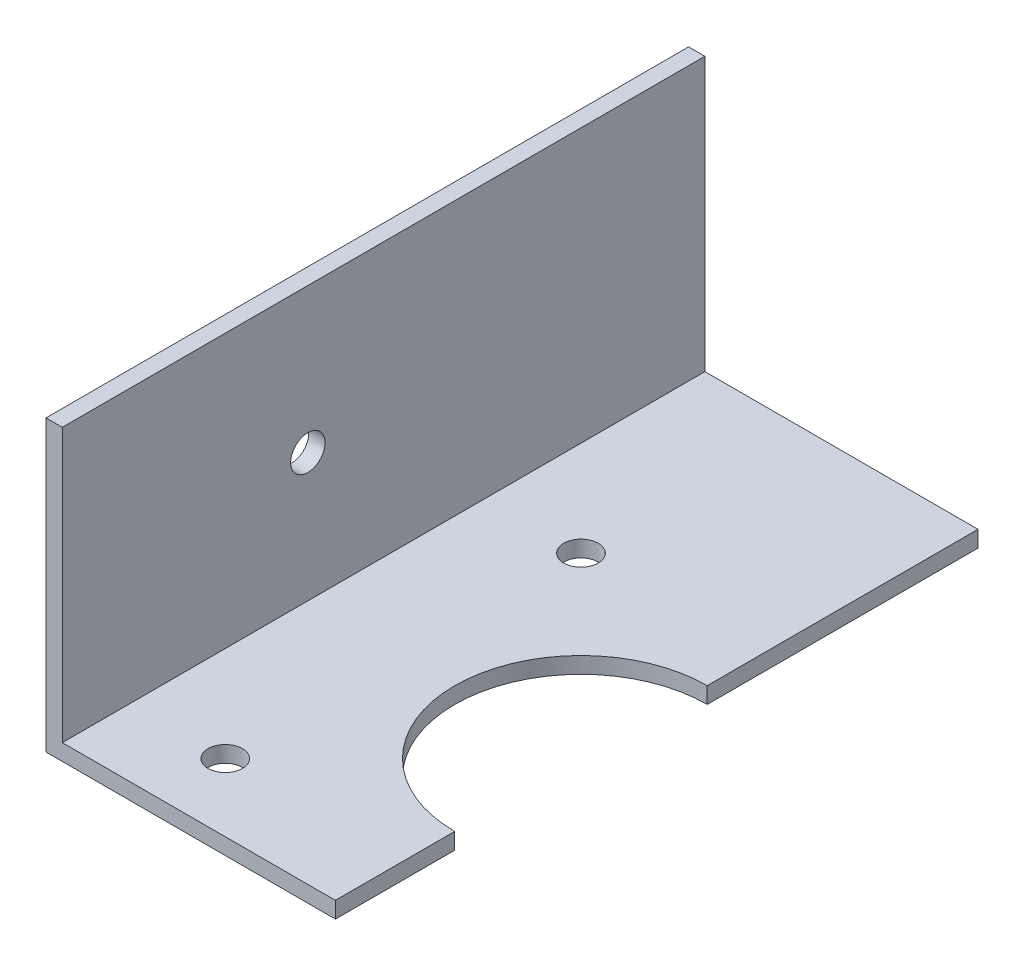
ISO-10303-21;
HEADER;
FILE_DESCRIPTION(('STEP AP214'),'2;1');
FILE_NAME('part.step','',(''),(''),'','','');
FILE_SCHEMA(('AUTOMOTIVE_DESIGN { 1 0 10303 214 1 1 1 1 }'));
ENDSEC;
DATA;
#1=APPLICATION_CONTEXT('core data for automotive mechanical design processes');
#2=APPLICATION_PROTOCOL_DEFINITION('international standard','automotive_design',2000,#1);
#3=PRODUCT_CONTEXT('',#1,'mechanical');
#4=PRODUCT('Part','Part','',(#3));
#5=PRODUCT_RELATED_PRODUCT_CATEGORY('part','',(#4));
#6=PRODUCT_DEFINITION_FORMATION('','',#4);
#7=PRODUCT_DEFINITION_CONTEXT('part definition',#1,'design');
#8=PRODUCT_DEFINITION('design','',#6,#7);
#9=PRODUCT_DEFINITION_SHAPE('','',#8);
#10=(LENGTH_UNIT() NAMED_UNIT(*) SI_UNIT(.MILLI.,.METRE.));
#11=(NAMED_UNIT(*) PLANE_ANGLE_UNIT() SI_UNIT($,.RADIAN.));
#12=(NAMED_UNIT(*) SI_UNIT($,.STERADIAN.) SOLID_ANGLE_UNIT());
#13=UNCERTAINTY_MEASURE_WITH_UNIT(LENGTH_MEASURE(1.E-05),#10,'distance_accuracy_value','');
#14=(GEOMETRIC_REPRESENTATION_CONTEXT(3) GLOBAL_UNCERTAINTY_ASSIGNED_CONTEXT((#13)) GLOBAL_UNIT_ASSIGNED_CONTEXT((#10,
#11,#12)) REPRESENTATION_CONTEXT('',''));
#15=CARTESIAN_POINT('',(0.,0.,0.));
#16=DIRECTION('',(0.,0.,1.));
#17=DIRECTION('',(1.,0.,0.));
#18=AXIS2_PLACEMENT_3D('',#15,#16,#17);
#19=CARTESIAN_POINT('',(25.22,-25.22,56.));
#20=DIRECTION('',(-1.,0.,0.));
#21=DIRECTION('',(0.,0.,1.));
#22=AXIS2_PLACEMENT_3D('',#19,#20,#21);
#23=PLANE('',#22);
#24=DIRECTION('',(0.,0.,-1.));
#25=VECTOR('',#24,1.);
#26=CARTESIAN_POINT('',(25.22,-23.8,56.));
#27=LINE('',#26,#25);
#28=CARTESIAN_POINT('',(25.22,-23.8,23.6));
#29=VERTEX_POINT('',#28);
#30=CARTESIAN_POINT('',(25.22,-23.8,0.));
#31=VERTEX_POINT('',#30);
#32=EDGE_CURVE('E162',#29,#31,#27,.T.);
#33=ORIENTED_EDGE('',*,*,#32,.F.);
#34=DIRECTION('',(0.,-1.,0.));
#35=VECTOR('',#34,1.);
#36=CARTESIAN_POINT('',(25.22,0.,23.6));
#37=LINE('',#36,#35);
#38=CARTESIAN_POINT('',(25.22,-25.22,23.6));
#39=VERTEX_POINT('',#38);
#40=EDGE_CURVE('E44',#29,#39,#37,.T.);
#41=ORIENTED_EDGE('',*,*,#40,.T.);
#42=DIRECTION('',(0.,0.,-1.));
#43=VECTOR('',#42,1.);
#44=CARTESIAN_POINT('',(25.22,-25.22,56.));
#45=LINE('',#44,#43);
#46=CARTESIAN_POINT('',(25.22,-25.22,0.));
#47=VERTEX_POINT('',#46);
#48=EDGE_CURVE('E109',#39,#47,#45,.T.);
#49=ORIENTED_EDGE('',*,*,#48,.T.);
#50=DIRECTION('',(0.,1.,0.));
#51=VECTOR('',#50,1.);
#52=CARTESIAN_POINT('',(25.22,-25.22,0.));
#53=LINE('',#52,#51);
#54=EDGE_CURVE('E141',#47,#31,#53,.T.);
#55=ORIENTED_EDGE('',*,*,#54,.T.);
#56=EDGE_LOOP('',(#33,#41,#49,#55));
#57=FACE_BOUND('',#56,.T.);
#58=ADVANCED_FACE('F29',(#57),#23,.F.);
#59=CARTESIAN_POINT('',(1.42,0.,56.));
#60=DIRECTION('',(0.,-1.,0.));
#61=DIRECTION('',(0.,0.,-1.));
#62=AXIS2_PLACEMENT_3D('',#59,#60,#61);
#63=PLANE('',#62);
#64=DIRECTION('',(-1.,0.,0.));
#65=VECTOR('',#64,1.);
#66=CARTESIAN_POINT('',(1.42,0.,0.));
#67=LINE('',#66,#65);
#68=CARTESIAN_POINT('',(1.42,0.,0.));
#69=VERTEX_POINT('',#68);
#70=CARTESIAN_POINT('',(0.,0.,0.));
#71=VERTEX_POINT('',#70);
#72=EDGE_CURVE('E125',#69,#71,#67,.T.);
#73=ORIENTED_EDGE('',*,*,#72,.T.);
#74=DIRECTION('',(0.,0.,-1.));
#75=VECTOR('',#74,1.);
#76=CARTESIAN_POINT('',(0.,0.,56.));
#77=LINE('',#76,#75);
#78=CARTESIAN_POINT('',(0.,0.,56.));
#79=VERTEX_POINT('',#78);
#80=EDGE_CURVE('E37',#79,#71,#77,.T.);
#81=ORIENTED_EDGE('',*,*,#80,.F.);
#82=DIRECTION('',(-1.,0.,0.));
#83=VECTOR('',#82,1.);
#84=CARTESIAN_POINT('',(1.42,0.,56.));
#85=LINE('',#84,#83);
#86=CARTESIAN_POINT('',(1.42,0.,56.));
#87=VERTEX_POINT('',#86);
#88=EDGE_CURVE('E148',#87,#79,#85,.T.);
#89=ORIENTED_EDGE('',*,*,#88,.F.);
#90=DIRECTION('',(0.,0.,-1.));
#91=VECTOR('',#90,1.);
#92=CARTESIAN_POINT('',(1.42,0.,56.));
#93=LINE('',#92,#91);
#94=EDGE_CURVE('E158',#87,#69,#93,.T.);
#95=ORIENTED_EDGE('',*,*,#94,.T.);
#96=EDGE_LOOP('',(#73,#81,#89,#95));
#97=FACE_BOUND('',#96,.T.);
#98=ADVANCED_FACE('F31',(#97),#63,.F.);
#99=CARTESIAN_POINT('',(0.,0.,56.));
#100=DIRECTION('',(1.,0.,0.));
#101=DIRECTION('',(0.,0.,-1.));
#102=AXIS2_PLACEMENT_3D('',#99,#100,#101);
#103=PLANE('',#102);
#104=CARTESIAN_POINT('',(0.,-12.61,34.6));
#105=DIRECTION('',(-1.,0.,0.));
#106=DIRECTION('',(0.,0.,1.));
#107=AXIS2_PLACEMENT_3D('',#104,#105,#106);
#108=CIRCLE('',#107,1.5);
#109=CARTESIAN_POINT('',(0.,-12.61,36.1));
#110=VERTEX_POINT('',#109);
#111=EDGE_CURVE('E126',#110,#110,#108,.T.);
#112=ORIENTED_EDGE('',*,*,#111,.F.);
#113=EDGE_LOOP('',(#112));
#114=FACE_BOUND('',#113,.T.);
#115=DIRECTION('',(0.,-1.,0.));
#116=VECTOR('',#115,1.);
#117=CARTESIAN_POINT('',(0.,0.,0.));
#118=LINE('',#117,#116);
#119=CARTESIAN_POINT('',(0.,-25.22,0.));
#120=VERTEX_POINT('',#119);
#121=EDGE_CURVE('E130',#71,#120,#118,.T.);
#122=ORIENTED_EDGE('',*,*,#121,.T.);
#123=DIRECTION('',(0.,0.,-1.));
#124=VECTOR('',#123,1.);
#125=CARTESIAN_POINT('',(0.,-25.22,56.));
#126=LINE('',#125,#124);
#127=CARTESIAN_POINT('',(0.,-25.22,56.));
#128=VERTEX_POINT('',#127);
#129=EDGE_CURVE('E114',#128,#120,#126,.T.);
#130=ORIENTED_EDGE('',*,*,#129,.F.);
#131=DIRECTION('',(0.,-1.,0.));
#132=VECTOR('',#131,1.);
#133=CARTESIAN_POINT('',(0.,0.,56.));
#134=LINE('',#133,#132);
#135=EDGE_CURVE('E150',#79,#128,#134,.T.);
#136=ORIENTED_EDGE('',*,*,#135,.F.);
#137=ORIENTED_EDGE('',*,*,#80,.T.);
#138=EDGE_LOOP('',(#122,#130,#136,#137));
#139=FACE_BOUND('',#138,.T.);
#140=ADVANCED_FACE('F185',(#114,#139),#103,.F.);
#141=CARTESIAN_POINT('',(25.22,-25.22,56.));
#142=DIRECTION('',(0.,1.,0.));
#143=DIRECTION('',(-1.,0.,0.));
#144=AXIS2_PLACEMENT_3D('',#141,#142,#143);
#145=PLANE('',#144);
#146=CARTESIAN_POINT('',(9.72,-25.22,50.1));
#147=DIRECTION('',(0.,-1.,0.));
#148=DIRECTION('',(1.,0.,0.));
#149=AXIS2_PLACEMENT_3D('',#146,#147,#148);
#150=CIRCLE('',#149,1.5);
#151=CARTESIAN_POINT('',(11.22,-25.22,50.1));
#152=VERTEX_POINT('',#151);
#153=EDGE_CURVE('E204',#152,#152,#150,.T.);
#154=ORIENTED_EDGE('',*,*,#153,.F.);
#155=EDGE_LOOP('',(#154));
#156=FACE_BOUND('',#155,.T.);
#157=CARTESIAN_POINT('',(9.72,-25.22,19.1));
#158=DIRECTION('',(0.,-1.,0.));
#159=DIRECTION('',(1.,0.,0.));
#160=AXIS2_PLACEMENT_3D('',#157,#158,#159);
#161=CIRCLE('',#160,1.5);
#162=CARTESIAN_POINT('',(11.22,-25.22,19.1));
#163=VERTEX_POINT('',#162);
#164=EDGE_CURVE('E207',#163,#163,#161,.T.);
#165=ORIENTED_EDGE('',*,*,#164,.F.);
#166=EDGE_LOOP('',(#165));
#167=FACE_BOUND('',#166,.T.);
#168=ORIENTED_EDGE('',*,*,#48,.F.);
#169=CARTESIAN_POINT('',(25.22,-25.22,34.6));
#170=DIRECTION('',(0.,-1.,0.));
#171=DIRECTION('',(1.,0.,0.));
#172=AXIS2_PLACEMENT_3D('',#169,#170,#171);
#173=CIRCLE('',#172,11.);
#174=CARTESIAN_POINT('',(25.22,-25.22,45.6));
#175=VERTEX_POINT('',#174);
#176=EDGE_CURVE('E95',#175,#39,#173,.T.);
#177=ORIENTED_EDGE('',*,*,#176,.F.);
#178=CARTESIAN_POINT('',(25.22,-25.22,56.));
#179=VERTEX_POINT('',#178);
#180=EDGE_CURVE('E106',#179,#175,#45,.T.);
#181=ORIENTED_EDGE('',*,*,#180,.F.);
#182=DIRECTION('',(1.,0.,0.));
#183=VECTOR('',#182,1.);
#184=CARTESIAN_POINT('',(25.22,-25.22,56.));
#185=LINE('',#184,#183);
#186=EDGE_CURVE('E152',#128,#179,#185,.T.);
#187=ORIENTED_EDGE('',*,*,#186,.F.);
#188=ORIENTED_EDGE('',*,*,#129,.T.);
#189=DIRECTION('',(1.,0.,0.));
#190=VECTOR('',#189,1.);
#191=CARTESIAN_POINT('',(25.22,-25.22,0.));
#192=LINE('',#191,#190);
#193=EDGE_CURVE('E139',#120,#47,#192,.T.);
#194=ORIENTED_EDGE('',*,*,#193,.T.);
#195=EDGE_LOOP('',(#168,#177,#181,#187,#188,#194));
#196=FACE_BOUND('',#195,.T.);
#197=ADVANCED_FACE('F104',(#156,#167,#196),#145,.F.);
#198=ORIENTED_EDGE('',*,*,#180,.T.);
#199=DIRECTION('',(0.,-1.,0.));
#200=VECTOR('',#199,1.);
#201=CARTESIAN_POINT('',(25.22,0.,45.6));
#202=LINE('',#201,#200);
#203=CARTESIAN_POINT('',(25.22,-23.8,45.6));
#204=VERTEX_POINT('',#203);
#205=EDGE_CURVE('E92',#175,#204,#202,.F.);
#206=ORIENTED_EDGE('',*,*,#205,.T.);
#207=CARTESIAN_POINT('',(25.22,-23.8,56.));
#208=VERTEX_POINT('',#207);
#209=EDGE_CURVE('E118',#208,#204,#27,.T.);
#210=ORIENTED_EDGE('',*,*,#209,.F.);
#211=DIRECTION('',(0.,1.,0.));
#212=VECTOR('',#211,1.);
#213=CARTESIAN_POINT('',(25.22,-25.22,56.));
#214=LINE('',#213,#212);
#215=EDGE_CURVE('E113',#179,#208,#214,.T.);
#216=ORIENTED_EDGE('',*,*,#215,.F.);
#217=EDGE_LOOP('',(#198,#206,#210,#216));
#218=FACE_BOUND('',#217,.T.);
#219=ADVANCED_FACE('F112',(#218),#23,.F.);
#220=CARTESIAN_POINT('',(25.22,-23.8,56.));
#221=DIRECTION('',(0.,-1.,0.));
#222=DIRECTION('',(1.,0.,0.));
#223=AXIS2_PLACEMENT_3D('',#220,#221,#222);
#224=PLANE('',#223);
#225=CARTESIAN_POINT('',(9.72,-23.8,50.1));
#226=DIRECTION('',(0.,-1.,0.));
#227=DIRECTION('',(1.,0.,0.));
#228=AXIS2_PLACEMENT_3D('',#225,#226,#227);
#229=CIRCLE('',#228,1.5);
#230=CARTESIAN_POINT('',(11.22,-23.8,50.1));
#231=VERTEX_POINT('',#230);
#232=EDGE_CURVE('E209',#231,#231,#229,.T.);
#233=ORIENTED_EDGE('',*,*,#232,.T.);
#234=EDGE_LOOP('',(#233));
#235=FACE_BOUND('',#234,.T.);
#236=CARTESIAN_POINT('',(9.72,-23.8,19.1));
#237=DIRECTION('',(0.,-1.,0.));
#238=DIRECTION('',(1.,0.,0.));
#239=AXIS2_PLACEMENT_3D('',#236,#237,#238);
#240=CIRCLE('',#239,1.5);
#241=CARTESIAN_POINT('',(11.22,-23.8,19.1));
#242=VERTEX_POINT('',#241);
#243=EDGE_CURVE('E110',#242,#242,#240,.T.);
#244=ORIENTED_EDGE('',*,*,#243,.T.);
#245=EDGE_LOOP('',(#244));
#246=FACE_BOUND('',#245,.T.);
#247=ORIENTED_EDGE('',*,*,#209,.T.);
#248=CARTESIAN_POINT('',(25.22,-23.8,34.6));
#249=DIRECTION('',(0.,-1.,0.));
#250=DIRECTION('',(1.,0.,0.));
#251=AXIS2_PLACEMENT_3D('',#248,#249,#250);
#252=CIRCLE('',#251,11.);
#253=EDGE_CURVE('E11',#204,#29,#252,.T.);
#254=ORIENTED_EDGE('',*,*,#253,.T.);
#255=ORIENTED_EDGE('',*,*,#32,.T.);
#256=DIRECTION('',(-1.,0.,0.));
#257=VECTOR('',#256,1.);
#258=CARTESIAN_POINT('',(25.22,-23.8,0.));
#259=LINE('',#258,#257);
#260=CARTESIAN_POINT('',(1.42,-23.8,0.));
#261=VERTEX_POINT('',#260);
#262=EDGE_CURVE('E144',#31,#261,#259,.T.);
#263=ORIENTED_EDGE('',*,*,#262,.T.);
#264=DIRECTION('',(0.,0.,-1.));
#265=VECTOR('',#264,1.);
#266=CARTESIAN_POINT('',(1.42,-23.8,56.));
#267=LINE('',#266,#265);
#268=CARTESIAN_POINT('',(1.42,-23.8,56.));
#269=VERTEX_POINT('',#268);
#270=EDGE_CURVE('E160',#269,#261,#267,.T.);
#271=ORIENTED_EDGE('',*,*,#270,.F.);
#272=DIRECTION('',(-1.,0.,0.));
#273=VECTOR('',#272,1.);
#274=CARTESIAN_POINT('',(25.22,-23.8,56.));
#275=LINE('',#274,#273);
#276=EDGE_CURVE('E155',#208,#269,#275,.T.);
#277=ORIENTED_EDGE('',*,*,#276,.F.);
#278=EDGE_LOOP('',(#247,#254,#255,#263,#271,#277));
#279=FACE_BOUND('',#278,.T.);
#280=ADVANCED_FACE('F169',(#235,#246,#279),#224,.F.);
#281=CARTESIAN_POINT('',(1.42,0.,56.));
#282=DIRECTION('',(-1.,0.,0.));
#283=DIRECTION('',(0.,-1.,0.));
#284=AXIS2_PLACEMENT_3D('',#281,#282,#283);
#285=PLANE('',#284);
#286=CARTESIAN_POINT('',(1.42,-12.61,34.6));
#287=DIRECTION('',(-1.,0.,0.));
#288=DIRECTION('',(0.,-1.,0.));
#289=AXIS2_PLACEMENT_3D('',#286,#287,#288);
#290=CIRCLE('',#289,1.5);
#291=CARTESIAN_POINT('',(1.42,-14.11,34.6));
#292=VERTEX_POINT('',#291);
#293=EDGE_CURVE('E123',#292,#292,#290,.T.);
#294=ORIENTED_EDGE('',*,*,#293,.T.);
#295=EDGE_LOOP('',(#294));
#296=FACE_BOUND('',#295,.T.);
#297=DIRECTION('',(0.,1.,0.));
#298=VECTOR('',#297,1.);
#299=CARTESIAN_POINT('',(1.42,0.,0.));
#300=LINE('',#299,#298);
#301=EDGE_CURVE('E146',#261,#69,#300,.T.);
#302=ORIENTED_EDGE('',*,*,#301,.T.);
#303=ORIENTED_EDGE('',*,*,#94,.F.);
#304=DIRECTION('',(0.,1.,0.));
#305=VECTOR('',#304,1.);
#306=CARTESIAN_POINT('',(1.42,0.,56.));
#307=LINE('',#306,#305);
#308=EDGE_CURVE('E51',#269,#87,#307,.T.);
#309=ORIENTED_EDGE('',*,*,#308,.F.);
#310=ORIENTED_EDGE('',*,*,#270,.T.);
#311=EDGE_LOOP('',(#302,#303,#309,#310));
#312=FACE_BOUND('',#311,.T.);
#313=ADVANCED_FACE('F194',(#296,#312),#285,.F.);
#314=CARTESIAN_POINT('',(0.,0.,56.));
#315=DIRECTION('',(0.,0.,1.));
#316=DIRECTION('',(1.,0.,0.));
#317=AXIS2_PLACEMENT_3D('',#314,#315,#316);
#318=PLANE('',#317);
#319=ORIENTED_EDGE('',*,*,#88,.T.);
#320=ORIENTED_EDGE('',*,*,#135,.T.);
#321=ORIENTED_EDGE('',*,*,#186,.T.);
#322=ORIENTED_EDGE('',*,*,#215,.T.);
#323=ORIENTED_EDGE('',*,*,#276,.T.);
#324=ORIENTED_EDGE('',*,*,#308,.T.);
#325=EDGE_LOOP('',(#319,#320,#321,#322,#323,#324));
#326=FACE_BOUND('',#325,.T.);
#327=ADVANCED_FACE('F170',(#326),#318,.T.);
#328=CARTESIAN_POINT('',(0.,0.,0.));
#329=DIRECTION('',(0.,0.,1.));
#330=DIRECTION('',(1.,0.,0.));
#331=AXIS2_PLACEMENT_3D('',#328,#329,#330);
#332=PLANE('',#331);
#333=ORIENTED_EDGE('',*,*,#72,.F.);
#334=ORIENTED_EDGE('',*,*,#301,.F.);
#335=ORIENTED_EDGE('',*,*,#262,.F.);
#336=ORIENTED_EDGE('',*,*,#54,.F.);
#337=ORIENTED_EDGE('',*,*,#193,.F.);
#338=ORIENTED_EDGE('',*,*,#121,.F.);
#339=EDGE_LOOP('',(#333,#334,#335,#336,#337,#338));
#340=FACE_BOUND('',#339,.T.);
#341=ADVANCED_FACE('F177',(#340),#332,.F.);
#342=CARTESIAN_POINT('',(25.22,-12.61,34.6));
#343=DIRECTION('',(-1.,0.,0.));
#344=DIRECTION('',(0.,0.,1.));
#345=AXIS2_PLACEMENT_3D('',#342,#343,#344);
#346=CYLINDRICAL_SURFACE('',#345,1.5);
#347=ORIENTED_EDGE('',*,*,#111,.T.);
#348=EDGE_LOOP('',(#347));
#349=FACE_BOUND('',#348,.T.);
#350=ORIENTED_EDGE('',*,*,#293,.F.);
#351=EDGE_LOOP('',(#350));
#352=FACE_BOUND('',#351,.T.);
#353=ADVANCED_FACE('F231',(#349,#352),#346,.F.);
#354=CARTESIAN_POINT('',(25.22,0.,34.6));
#355=DIRECTION('',(0.,-1.,0.));
#356=DIRECTION('',(1.,0.,0.));
#357=AXIS2_PLACEMENT_3D('',#354,#355,#356);
#358=CYLINDRICAL_SURFACE('',#357,11.);
#359=ORIENTED_EDGE('',*,*,#253,.F.);
#360=ORIENTED_EDGE('',*,*,#205,.F.);
#361=ORIENTED_EDGE('',*,*,#176,.T.);
#362=ORIENTED_EDGE('',*,*,#40,.F.);
#363=EDGE_LOOP('',(#359,#360,#361,#362));
#364=FACE_BOUND('',#363,.T.);
#365=ADVANCED_FACE('F94',(#364),#358,.F.);
#366=CARTESIAN_POINT('',(9.72,0.,19.1));
#367=DIRECTION('',(0.,-1.,0.));
#368=DIRECTION('',(1.,0.,0.));
#369=AXIS2_PLACEMENT_3D('',#366,#367,#368);
#370=CYLINDRICAL_SURFACE('',#369,1.5);
#371=ORIENTED_EDGE('',*,*,#164,.T.);
#372=EDGE_LOOP('',(#371));
#373=FACE_BOUND('',#372,.T.);
#374=ORIENTED_EDGE('',*,*,#243,.F.);
#375=EDGE_LOOP('',(#374));
#376=FACE_BOUND('',#375,.T.);
#377=ADVANCED_FACE('F220',(#373,#376),#370,.F.);
#378=CARTESIAN_POINT('',(9.72,0.,50.1));
#379=DIRECTION('',(0.,-1.,0.));
#380=DIRECTION('',(1.,0.,0.));
#381=AXIS2_PLACEMENT_3D('',#378,#379,#380);
#382=CYLINDRICAL_SURFACE('',#381,1.5);
#383=ORIENTED_EDGE('',*,*,#153,.T.);
#384=EDGE_LOOP('',(#383));
#385=FACE_BOUND('',#384,.T.);
#386=ORIENTED_EDGE('',*,*,#232,.F.);
#387=EDGE_LOOP('',(#386));
#388=FACE_BOUND('',#387,.T.);
#389=ADVANCED_FACE('F217',(#385,#388),#382,.F.);
#390=CLOSED_SHELL('',(#58,#98,#140,#197,#219,#280,#313,#327,#341,#353,#365,#377,#389));
#391=MANIFOLD_SOLID_BREP('B2',#390);
#392=ADVANCED_BREP_SHAPE_REPRESENTATION('',(#18,#391),#14);
#393=SHAPE_DEFINITION_REPRESENTATION(#9,#392);
ENDSEC;
END-ISO-10303-21;
